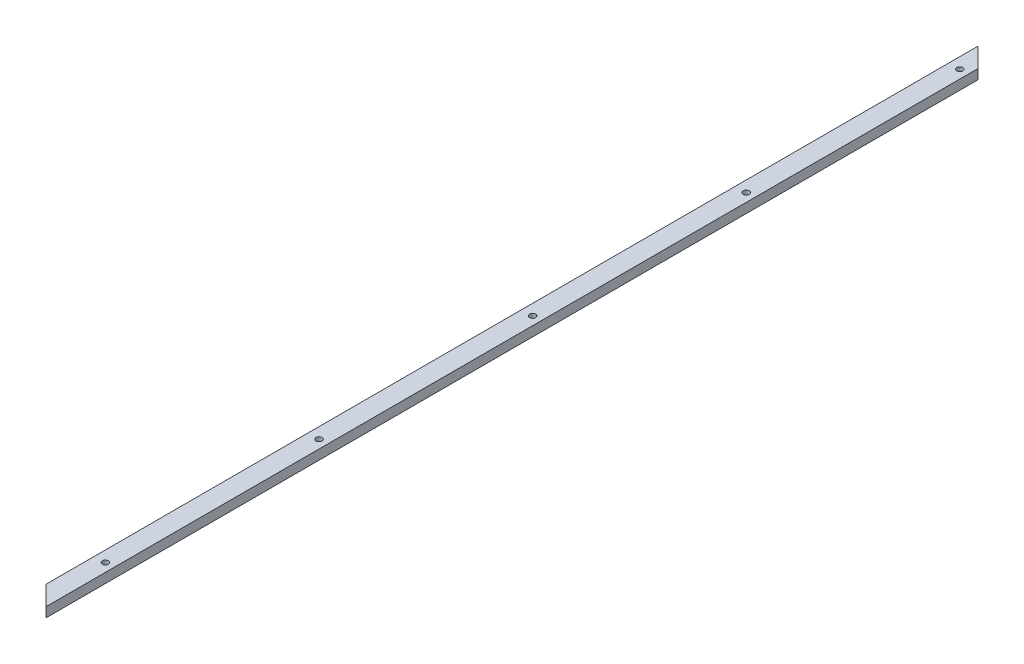
ISO-10303-21;
HEADER;
FILE_DESCRIPTION(('STEP AP214'),'2;1');
FILE_NAME('part.step','',(''),(''),'','','');
FILE_SCHEMA(('AUTOMOTIVE_DESIGN { 1 0 10303 214 1 1 1 1 }'));
ENDSEC;
DATA;
#1=APPLICATION_CONTEXT('core data for automotive mechanical design processes');
#2=APPLICATION_PROTOCOL_DEFINITION('international standard','automotive_design',2000,#1);
#3=PRODUCT_CONTEXT('',#1,'mechanical');
#4=PRODUCT('Part','Part','',(#3));
#5=PRODUCT_RELATED_PRODUCT_CATEGORY('part','',(#4));
#6=PRODUCT_DEFINITION_FORMATION('','',#4);
#7=PRODUCT_DEFINITION_CONTEXT('part definition',#1,'design');
#8=PRODUCT_DEFINITION('design','',#6,#7);
#9=PRODUCT_DEFINITION_SHAPE('','',#8);
#10=(LENGTH_UNIT() NAMED_UNIT(*) SI_UNIT(.MILLI.,.METRE.));
#11=(NAMED_UNIT(*) PLANE_ANGLE_UNIT() SI_UNIT($,.RADIAN.));
#12=(NAMED_UNIT(*) SI_UNIT($,.STERADIAN.) SOLID_ANGLE_UNIT());
#13=UNCERTAINTY_MEASURE_WITH_UNIT(LENGTH_MEASURE(1.E-05),#10,'distance_accuracy_value','');
#14=(GEOMETRIC_REPRESENTATION_CONTEXT(3) GLOBAL_UNCERTAINTY_ASSIGNED_CONTEXT((#13)) GLOBAL_UNIT_ASSIGNED_CONTEXT((#10,
#11,#12)) REPRESENTATION_CONTEXT('',''));
#15=CARTESIAN_POINT('',(0.,0.,0.));
#16=DIRECTION('',(0.,0.,1.));
#17=DIRECTION('',(1.,0.,0.));
#18=AXIS2_PLACEMENT_3D('',#15,#16,#17);
#19=CARTESIAN_POINT('',(-38.1,0.,1219.2));
#20=DIRECTION('',(0.,1.,0.));
#21=DIRECTION('',(0.,0.,1.));
#22=AXIS2_PLACEMENT_3D('',#19,#20,#21);
#23=PLANE('',#22);
#24=CARTESIAN_POINT('',(-11.1124999999941,0.,50.8000000000001));
#25=DIRECTION('',(0.,-1.,0.));
#26=DIRECTION('',(0.,0.,-1.));
#27=AXIS2_PLACEMENT_3D('',#24,#25,#26);
#28=CIRCLE('',#27,3.96875);
#29=CARTESIAN_POINT('',(-11.1124999999941,0.,46.8312500000001));
#30=VERTEX_POINT('',#29);
#31=EDGE_CURVE('E116',#30,#30,#28,.T.);
#32=ORIENTED_EDGE('',*,*,#31,.F.);
#33=EDGE_LOOP('',(#32));
#34=FACE_BOUND('',#33,.T.);
#35=CARTESIAN_POINT('',(-11.1124999999971,0.,330.2));
#36=DIRECTION('',(0.,-1.,0.));
#37=DIRECTION('',(0.,0.,-1.));
#38=AXIS2_PLACEMENT_3D('',#35,#36,#37);
#39=CIRCLE('',#38,3.96875);
#40=CARTESIAN_POINT('',(-11.1124999999971,0.,326.23125));
#41=VERTEX_POINT('',#40);
#42=EDGE_CURVE('E122',#41,#41,#39,.T.);
#43=ORIENTED_EDGE('',*,*,#42,.F.);
#44=EDGE_LOOP('',(#43));
#45=FACE_BOUND('',#44,.T.);
#46=CARTESIAN_POINT('',(-11.1125,0.,609.6));
#47=DIRECTION('',(0.,-1.,0.));
#48=DIRECTION('',(0.,0.,-1.));
#49=AXIS2_PLACEMENT_3D('',#46,#47,#48);
#50=CIRCLE('',#49,3.96875);
#51=CARTESIAN_POINT('',(-11.1125,0.,605.63125));
#52=VERTEX_POINT('',#51);
#53=EDGE_CURVE('E128',#52,#52,#50,.T.);
#54=ORIENTED_EDGE('',*,*,#53,.F.);
#55=EDGE_LOOP('',(#54));
#56=FACE_BOUND('',#55,.T.);
#57=CARTESIAN_POINT('',(-11.1125000000029,0.,889.));
#58=DIRECTION('',(0.,-1.,0.));
#59=DIRECTION('',(0.,0.,-1.));
#60=AXIS2_PLACEMENT_3D('',#57,#58,#59);
#61=CIRCLE('',#60,3.96875);
#62=CARTESIAN_POINT('',(-11.1125000000029,0.,885.03125));
#63=VERTEX_POINT('',#62);
#64=EDGE_CURVE('E134',#63,#63,#61,.T.);
#65=ORIENTED_EDGE('',*,*,#64,.F.);
#66=EDGE_LOOP('',(#65));
#67=FACE_BOUND('',#66,.T.);
#68=CARTESIAN_POINT('',(-11.1125000000059,0.,1168.4));
#69=DIRECTION('',(0.,-1.,0.));
#70=DIRECTION('',(0.,0.,-1.));
#71=AXIS2_PLACEMENT_3D('',#68,#69,#70);
#72=CIRCLE('',#71,3.96875);
#73=CARTESIAN_POINT('',(-11.1125000000059,0.,1164.43125));
#74=VERTEX_POINT('',#73);
#75=EDGE_CURVE('E142',#74,#74,#72,.T.);
#76=ORIENTED_EDGE('',*,*,#75,.F.);
#77=EDGE_LOOP('',(#76));
#78=FACE_BOUND('',#77,.T.);
#79=DIRECTION('',(0.,0.,-1.));
#80=VECTOR('',#79,1.);
#81=CARTESIAN_POINT('',(-38.1,0.,1219.2));
#82=LINE('',#81,#80);
#83=CARTESIAN_POINT('',(-38.1,0.,1219.2));
#84=VERTEX_POINT('',#83);
#85=CARTESIAN_POINT('',(-38.1,0.,0.));
#86=VERTEX_POINT('',#85);
#87=EDGE_CURVE('E79',#84,#86,#82,.T.);
#88=ORIENTED_EDGE('',*,*,#87,.T.);
#89=DIRECTION('',(0.707106781186551,0.,0.707106781186544));
#90=VECTOR('',#89,1.);
#91=CARTESIAN_POINT('',(0.,0.,38.0999999999996));
#92=LINE('',#91,#90);
#93=CARTESIAN_POINT('',(0.,0.,38.0999999999996));
#94=VERTEX_POINT('',#93);
#95=EDGE_CURVE('E51',#86,#94,#92,.T.);
#96=ORIENTED_EDGE('',*,*,#95,.T.);
#97=DIRECTION('',(0.,0.,-1.));
#98=VECTOR('',#97,1.);
#99=CARTESIAN_POINT('',(0.,0.,1219.2));
#100=LINE('',#99,#98);
#101=CARTESIAN_POINT('',(0.,0.,1257.3));
#102=VERTEX_POINT('',#101);
#103=EDGE_CURVE('E11',#102,#94,#100,.T.);
#104=ORIENTED_EDGE('',*,*,#103,.F.);
#105=DIRECTION('',(0.707106781186551,0.,0.707106781186544));
#106=VECTOR('',#105,1.);
#107=CARTESIAN_POINT('',(14.7142632281584,0.,1272.01426322816));
#108=LINE('',#107,#106);
#109=EDGE_CURVE('E95',#84,#102,#108,.T.);
#110=ORIENTED_EDGE('',*,*,#109,.F.);
#111=EDGE_LOOP('',(#88,#96,#104,#110));
#112=FACE_BOUND('',#111,.T.);
#113=ADVANCED_FACE('F36',(#34,#45,#56,#67,#78,#112),#23,.F.);
#114=CARTESIAN_POINT('',(0.,0.,1219.2));
#115=DIRECTION('',(-1.,0.,0.));
#116=DIRECTION('',(0.,0.,1.));
#117=AXIS2_PLACEMENT_3D('',#114,#115,#116);
#118=PLANE('',#117);
#119=ORIENTED_EDGE('',*,*,#103,.T.);
#120=DIRECTION('',(0.,1.,0.));
#121=VECTOR('',#120,1.);
#122=CARTESIAN_POINT('',(0.,0.,38.0999999999996));
#123=LINE('',#122,#121);
#124=CARTESIAN_POINT('',(0.,12.7,38.0999999999996));
#125=VERTEX_POINT('',#124);
#126=EDGE_CURVE('E111',#94,#125,#123,.T.);
#127=ORIENTED_EDGE('',*,*,#126,.T.);
#128=DIRECTION('',(0.,0.,-1.));
#129=VECTOR('',#128,1.);
#130=CARTESIAN_POINT('',(0.,12.7,1219.2));
#131=LINE('',#130,#129);
#132=CARTESIAN_POINT('',(0.,12.7,1257.3));
#133=VERTEX_POINT('',#132);
#134=EDGE_CURVE('E44',#133,#125,#131,.T.);
#135=ORIENTED_EDGE('',*,*,#134,.F.);
#136=DIRECTION('',(0.,1.,0.));
#137=VECTOR('',#136,1.);
#138=CARTESIAN_POINT('',(0.,12.7,1257.3));
#139=LINE('',#138,#137);
#140=EDGE_CURVE('E103',#102,#133,#139,.T.);
#141=ORIENTED_EDGE('',*,*,#140,.F.);
#142=EDGE_LOOP('',(#119,#127,#135,#141));
#143=FACE_BOUND('',#142,.T.);
#144=ADVANCED_FACE('F155',(#143),#118,.F.);
#145=CARTESIAN_POINT('',(0.,12.7,1219.2));
#146=DIRECTION('',(0.,-1.,0.));
#147=DIRECTION('',(1.,0.,0.));
#148=AXIS2_PLACEMENT_3D('',#145,#146,#147);
#149=PLANE('',#148);
#150=CARTESIAN_POINT('',(-11.1124999999941,12.7,50.8000000000001));
#151=DIRECTION('',(0.,-1.,0.));
#152=DIRECTION('',(0.,0.,-1.));
#153=AXIS2_PLACEMENT_3D('',#150,#151,#152);
#154=CIRCLE('',#153,3.96875);
#155=CARTESIAN_POINT('',(-11.1124999999941,12.7,46.8312500000001));
#156=VERTEX_POINT('',#155);
#157=EDGE_CURVE('E119',#156,#156,#154,.T.);
#158=ORIENTED_EDGE('',*,*,#157,.T.);
#159=EDGE_LOOP('',(#158));
#160=FACE_BOUND('',#159,.T.);
#161=CARTESIAN_POINT('',(-11.1124999999971,12.7,330.2));
#162=DIRECTION('',(0.,-1.,0.));
#163=DIRECTION('',(0.,0.,-1.));
#164=AXIS2_PLACEMENT_3D('',#161,#162,#163);
#165=CIRCLE('',#164,3.96875);
#166=CARTESIAN_POINT('',(-11.1124999999971,12.7,326.23125));
#167=VERTEX_POINT('',#166);
#168=EDGE_CURVE('E125',#167,#167,#165,.T.);
#169=ORIENTED_EDGE('',*,*,#168,.T.);
#170=EDGE_LOOP('',(#169));
#171=FACE_BOUND('',#170,.T.);
#172=CARTESIAN_POINT('',(-11.1125,12.7,609.6));
#173=DIRECTION('',(0.,-1.,0.));
#174=DIRECTION('',(0.,0.,-1.));
#175=AXIS2_PLACEMENT_3D('',#172,#173,#174);
#176=CIRCLE('',#175,3.96875);
#177=CARTESIAN_POINT('',(-11.1125,12.7,605.63125));
#178=VERTEX_POINT('',#177);
#179=EDGE_CURVE('E131',#178,#178,#176,.T.);
#180=ORIENTED_EDGE('',*,*,#179,.T.);
#181=EDGE_LOOP('',(#180));
#182=FACE_BOUND('',#181,.T.);
#183=CARTESIAN_POINT('',(-11.1125000000029,12.7,889.));
#184=DIRECTION('',(0.,-1.,0.));
#185=DIRECTION('',(0.,0.,-1.));
#186=AXIS2_PLACEMENT_3D('',#183,#184,#185);
#187=CIRCLE('',#186,3.96875);
#188=CARTESIAN_POINT('',(-11.1125000000029,12.7,885.03125));
#189=VERTEX_POINT('',#188);
#190=EDGE_CURVE('E138',#189,#189,#187,.T.);
#191=ORIENTED_EDGE('',*,*,#190,.T.);
#192=EDGE_LOOP('',(#191));
#193=FACE_BOUND('',#192,.T.);
#194=CARTESIAN_POINT('',(-11.1125000000059,12.7,1168.4));
#195=DIRECTION('',(0.,-1.,0.));
#196=DIRECTION('',(0.,0.,-1.));
#197=AXIS2_PLACEMENT_3D('',#194,#195,#196);
#198=CIRCLE('',#197,3.96875);
#199=CARTESIAN_POINT('',(-11.1125000000059,12.7,1164.43125));
#200=VERTEX_POINT('',#199);
#201=EDGE_CURVE('E88',#200,#200,#198,.T.);
#202=ORIENTED_EDGE('',*,*,#201,.T.);
#203=EDGE_LOOP('',(#202));
#204=FACE_BOUND('',#203,.T.);
#205=ORIENTED_EDGE('',*,*,#134,.T.);
#206=DIRECTION('',(0.707106781186551,0.,0.707106781186544));
#207=VECTOR('',#206,1.);
#208=CARTESIAN_POINT('',(0.,12.7,38.0999999999996));
#209=LINE('',#208,#207);
#210=CARTESIAN_POINT('',(-25.3999999999999,12.7,12.6999999999999));
#211=VERTEX_POINT('',#210);
#212=EDGE_CURVE('E102',#211,#125,#209,.T.);
#213=ORIENTED_EDGE('',*,*,#212,.F.);
#214=DIRECTION('',(0.,0.,-1.));
#215=VECTOR('',#214,1.);
#216=CARTESIAN_POINT('',(-25.3999999999999,12.7,1219.2));
#217=LINE('',#216,#215);
#218=CARTESIAN_POINT('',(-25.3999999999999,12.7,1231.9));
#219=VERTEX_POINT('',#218);
#220=EDGE_CURVE('E87',#219,#211,#217,.T.);
#221=ORIENTED_EDGE('',*,*,#220,.F.);
#222=DIRECTION('',(-0.707106781186551,0.,-0.707106781186544));
#223=VECTOR('',#222,1.);
#224=CARTESIAN_POINT('',(2.01426322815829,12.7,1259.31426322816));
#225=LINE('',#224,#223);
#226=EDGE_CURVE('E98',#133,#219,#225,.T.);
#227=ORIENTED_EDGE('',*,*,#226,.F.);
#228=EDGE_LOOP('',(#205,#213,#221,#227));
#229=FACE_BOUND('',#228,.T.);
#230=ADVANCED_FACE('F153',(#160,#171,#182,#193,#204,#229),#149,.F.);
#231=CARTESIAN_POINT('',(-25.3999999999999,12.7,1219.2));
#232=DIRECTION('',(0.707106781186544,-0.707106781186551,0.));
#233=DIRECTION('',(0.707106781186551,0.707106781186544,0.));
#234=AXIS2_PLACEMENT_3D('',#231,#232,#233);
#235=PLANE('',#234);
#236=ORIENTED_EDGE('',*,*,#220,.T.);
#237=DIRECTION('',(-0.57735026918963,-0.577350269189624,-0.577350269189624));
#238=VECTOR('',#237,1.);
#239=CARTESIAN_POINT('',(376.766666666668,414.866666666664,414.866666666664));
#240=LINE('',#239,#238);
#241=EDGE_CURVE('E55',#211,#86,#240,.T.);
#242=ORIENTED_EDGE('',*,*,#241,.T.);
#243=ORIENTED_EDGE('',*,*,#87,.F.);
#244=DIRECTION('',(-0.57735026918963,-0.577350269189624,-0.577350269189624));
#245=VECTOR('',#244,1.);
#246=CARTESIAN_POINT('',(-15.5904911812278,22.509508818772,1241.70950881877));
#247=LINE('',#246,#245);
#248=EDGE_CURVE('E83',#219,#84,#247,.T.);
#249=ORIENTED_EDGE('',*,*,#248,.F.);
#250=EDGE_LOOP('',(#236,#242,#243,#249));
#251=FACE_BOUND('',#250,.T.);
#252=ADVANCED_FACE('F82',(#251),#235,.F.);
#253=CARTESIAN_POINT('',(-11.1125000000059,0.,1168.4));
#254=DIRECTION('',(0.,-1.,0.));
#255=DIRECTION('',(0.,0.,-1.));
#256=AXIS2_PLACEMENT_3D('',#253,#254,#255);
#257=CYLINDRICAL_SURFACE('',#256,3.96875);
#258=ORIENTED_EDGE('',*,*,#201,.F.);
#259=EDGE_LOOP('',(#258));
#260=FACE_BOUND('',#259,.T.);
#261=ORIENTED_EDGE('',*,*,#75,.T.);
#262=EDGE_LOOP('',(#261));
#263=FACE_BOUND('',#262,.T.);
#264=ADVANCED_FACE('F183',(#260,#263),#257,.F.);
#265=CARTESIAN_POINT('',(-11.1125000000029,0.,889.));
#266=DIRECTION('',(0.,-1.,0.));
#267=DIRECTION('',(0.,0.,-1.));
#268=AXIS2_PLACEMENT_3D('',#265,#266,#267);
#269=CYLINDRICAL_SURFACE('',#268,3.96875);
#270=ORIENTED_EDGE('',*,*,#190,.F.);
#271=EDGE_LOOP('',(#270));
#272=FACE_BOUND('',#271,.T.);
#273=ORIENTED_EDGE('',*,*,#64,.T.);
#274=EDGE_LOOP('',(#273));
#275=FACE_BOUND('',#274,.T.);
#276=ADVANCED_FACE('F185',(#272,#275),#269,.F.);
#277=CARTESIAN_POINT('',(-11.1125,0.,609.6));
#278=DIRECTION('',(0.,-1.,0.));
#279=DIRECTION('',(0.,0.,-1.));
#280=AXIS2_PLACEMENT_3D('',#277,#278,#279);
#281=CYLINDRICAL_SURFACE('',#280,3.96875);
#282=ORIENTED_EDGE('',*,*,#179,.F.);
#283=EDGE_LOOP('',(#282));
#284=FACE_BOUND('',#283,.T.);
#285=ORIENTED_EDGE('',*,*,#53,.T.);
#286=EDGE_LOOP('',(#285));
#287=FACE_BOUND('',#286,.T.);
#288=ADVANCED_FACE('F192',(#284,#287),#281,.F.);
#289=CARTESIAN_POINT('',(-11.1124999999971,0.,330.2));
#290=DIRECTION('',(0.,-1.,0.));
#291=DIRECTION('',(0.,0.,-1.));
#292=AXIS2_PLACEMENT_3D('',#289,#290,#291);
#293=CYLINDRICAL_SURFACE('',#292,3.96875);
#294=ORIENTED_EDGE('',*,*,#168,.F.);
#295=EDGE_LOOP('',(#294));
#296=FACE_BOUND('',#295,.T.);
#297=ORIENTED_EDGE('',*,*,#42,.T.);
#298=EDGE_LOOP('',(#297));
#299=FACE_BOUND('',#298,.T.);
#300=ADVANCED_FACE('F165',(#296,#299),#293,.F.);
#301=CARTESIAN_POINT('',(-11.1124999999941,0.,50.8000000000001));
#302=DIRECTION('',(0.,-1.,0.));
#303=DIRECTION('',(0.,0.,-1.));
#304=AXIS2_PLACEMENT_3D('',#301,#302,#303);
#305=CYLINDRICAL_SURFACE('',#304,3.96875);
#306=ORIENTED_EDGE('',*,*,#157,.F.);
#307=EDGE_LOOP('',(#306));
#308=FACE_BOUND('',#307,.T.);
#309=ORIENTED_EDGE('',*,*,#31,.T.);
#310=EDGE_LOOP('',(#309));
#311=FACE_BOUND('',#310,.T.);
#312=ADVANCED_FACE('F158',(#308,#311),#305,.F.);
#313=CARTESIAN_POINT('',(0.,0.,38.0999999999996));
#314=DIRECTION('',(-0.707106781186544,0.,0.707106781186551));
#315=DIRECTION('',(0.707106781186551,0.,0.707106781186544));
#316=AXIS2_PLACEMENT_3D('',#313,#314,#315);
#317=PLANE('',#316);
#318=ORIENTED_EDGE('',*,*,#212,.T.);
#319=ORIENTED_EDGE('',*,*,#126,.F.);
#320=ORIENTED_EDGE('',*,*,#95,.F.);
#321=ORIENTED_EDGE('',*,*,#241,.F.);
#322=EDGE_LOOP('',(#318,#319,#320,#321));
#323=FACE_BOUND('',#322,.T.);
#324=ADVANCED_FACE('F156',(#323),#317,.F.);
#325=CARTESIAN_POINT('',(-628.65,0.,628.650000000007));
#326=DIRECTION('',(0.707106781186544,0.,-0.707106781186551));
#327=DIRECTION('',(-0.707106781186551,0.,-0.707106781186544));
#328=AXIS2_PLACEMENT_3D('',#325,#326,#327);
#329=PLANE('',#328);
#330=ORIENTED_EDGE('',*,*,#140,.T.);
#331=ORIENTED_EDGE('',*,*,#226,.T.);
#332=ORIENTED_EDGE('',*,*,#248,.T.);
#333=ORIENTED_EDGE('',*,*,#109,.T.);
#334=EDGE_LOOP('',(#330,#331,#332,#333));
#335=FACE_BOUND('',#334,.T.);
#336=ADVANCED_FACE('F94',(#335),#329,.F.);
#337=CLOSED_SHELL('',(#113,#144,#230,#252,#264,#276,#288,#300,#312,#324,#336));
#338=MANIFOLD_SOLID_BREP('B2',#337);
#339=ADVANCED_BREP_SHAPE_REPRESENTATION('',(#18,#338),#14);
#340=SHAPE_DEFINITION_REPRESENTATION(#9,#339);
ENDSEC;
END-ISO-10303-21;
